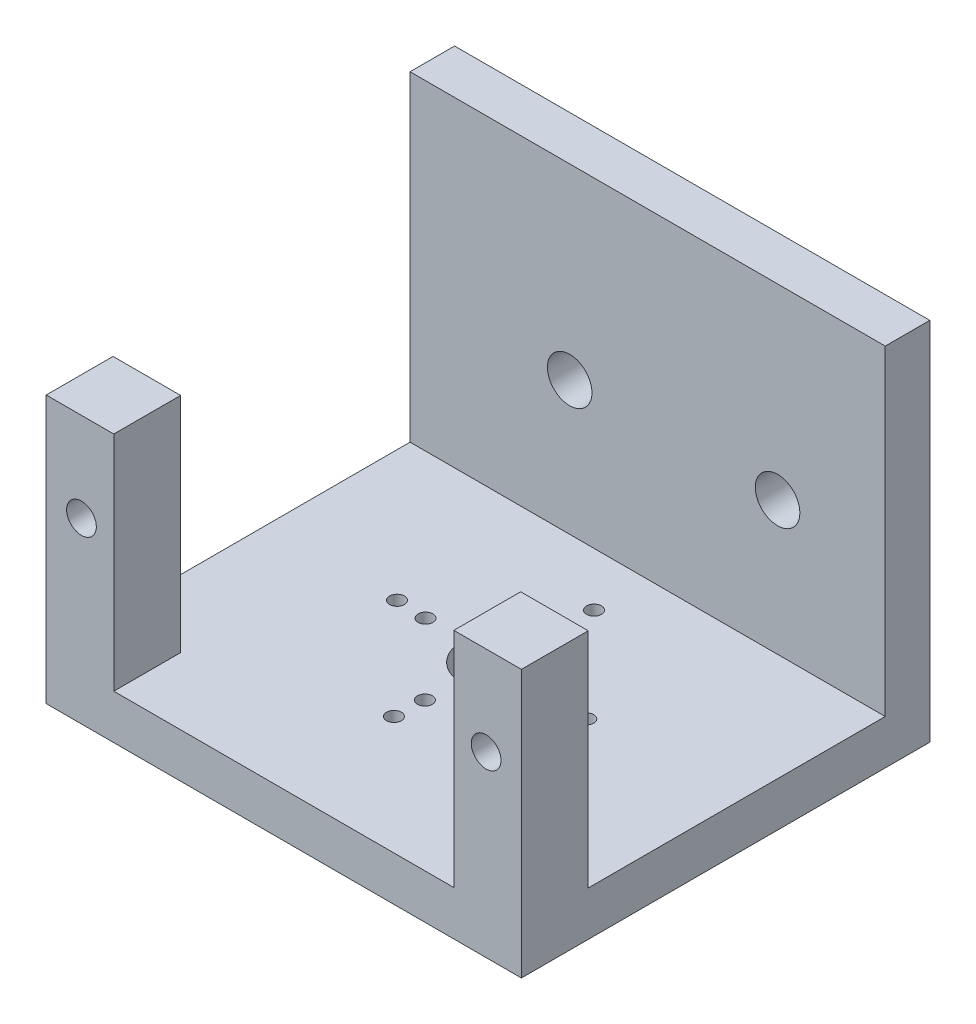
ISO-10303-21;
HEADER;
FILE_DESCRIPTION(('STEP AP214'),'2;1');
FILE_NAME('part.step','',(''),(''),'','','');
FILE_SCHEMA(('AUTOMOTIVE_DESIGN { 1 0 10303 214 1 1 1 1 }'));
ENDSEC;
DATA;
#1=APPLICATION_CONTEXT('core data for automotive mechanical design processes');
#2=APPLICATION_PROTOCOL_DEFINITION('international standard','automotive_design',2000,#1);
#3=PRODUCT_CONTEXT('',#1,'mechanical');
#4=PRODUCT('Part','Part','',(#3));
#5=PRODUCT_RELATED_PRODUCT_CATEGORY('part','',(#4));
#6=PRODUCT_DEFINITION_FORMATION('','',#4);
#7=PRODUCT_DEFINITION_CONTEXT('part definition',#1,'design');
#8=PRODUCT_DEFINITION('design','',#6,#7);
#9=PRODUCT_DEFINITION_SHAPE('','',#8);
#10=(LENGTH_UNIT() NAMED_UNIT(*) SI_UNIT(.MILLI.,.METRE.));
#11=(NAMED_UNIT(*) PLANE_ANGLE_UNIT() SI_UNIT($,.RADIAN.));
#12=(NAMED_UNIT(*) SI_UNIT($,.STERADIAN.) SOLID_ANGLE_UNIT());
#13=UNCERTAINTY_MEASURE_WITH_UNIT(LENGTH_MEASURE(1.E-05),#10,'distance_accuracy_value','');
#14=(GEOMETRIC_REPRESENTATION_CONTEXT(3) GLOBAL_UNCERTAINTY_ASSIGNED_CONTEXT((#13)) GLOBAL_UNIT_ASSIGNED_CONTEXT((#10,
#11,#12)) REPRESENTATION_CONTEXT('',''));
#15=CARTESIAN_POINT('',(0.,0.,0.));
#16=DIRECTION('',(0.,0.,1.));
#17=DIRECTION('',(1.,0.,0.));
#18=AXIS2_PLACEMENT_3D('',#15,#16,#17);
#19=CARTESIAN_POINT('',(0.,3.,0.));
#20=DIRECTION('',(0.,-1.,0.));
#21=DIRECTION('',(0.,0.,-1.));
#22=AXIS2_PLACEMENT_3D('',#19,#20,#21);
#23=PLANE('',#22);
#24=CARTESIAN_POINT('',(50.3881211809381,3.,-12.8250526524818));
#25=DIRECTION('',(0.,-1.,0.));
#26=DIRECTION('',(0.,0.,-1.));
#27=AXIS2_PLACEMENT_3D('',#24,#25,#26);
#28=CIRCLE('',#27,2.35);
#29=CARTESIAN_POINT('',(50.3881211809381,3.,-15.1750526524818));
#30=VERTEX_POINT('',#29);
#31=EDGE_CURVE('E159',#30,#30,#28,.T.);
#32=ORIENTED_EDGE('',*,*,#31,.T.);
#33=EDGE_LOOP('',(#32));
#34=FACE_BOUND('',#33,.T.);
#35=CARTESIAN_POINT('',(50.1172811230787,3.,-6.23061214072811));
#36=DIRECTION('',(0.,-1.,0.));
#37=DIRECTION('',(0.,0.,-1.));
#38=AXIS2_PLACEMENT_3D('',#35,#36,#37);
#39=CIRCLE('',#38,0.499999999999999);
#40=CARTESIAN_POINT('',(50.1172811230787,3.,-6.73061214072811));
#41=VERTEX_POINT('',#40);
#42=EDGE_CURVE('E216',#41,#41,#39,.T.);
#43=ORIENTED_EDGE('',*,*,#42,.T.);
#44=EDGE_LOOP('',(#43));
#45=FACE_BOUND('',#44,.T.);
#46=CARTESIAN_POINT('',(43.4439754905308,3.,-13.1102554406822));
#47=DIRECTION('',(0.,-1.,0.));
#48=DIRECTION('',(0.,0.,-1.));
#49=AXIS2_PLACEMENT_3D('',#46,#47,#48);
#50=CIRCLE('',#49,0.499999999999999);
#51=CARTESIAN_POINT('',(43.4439754905308,3.,-13.6102554406822));
#52=VERTEX_POINT('',#51);
#53=EDGE_CURVE('E213',#52,#52,#50,.T.);
#54=ORIENTED_EDGE('',*,*,#53,.T.);
#55=EDGE_LOOP('',(#54));
#56=FACE_BOUND('',#55,.T.);
#57=CARTESIAN_POINT('',(56.7327722793678,3.,-12.5644716877231));
#58=DIRECTION('',(0.,-1.,0.));
#59=DIRECTION('',(0.,0.,-1.));
#60=AXIS2_PLACEMENT_3D('',#57,#58,#59);
#61=CIRCLE('',#60,0.499999999999999);
#62=CARTESIAN_POINT('',(56.7327722793678,3.,-13.0644716877231));
#63=VERTEX_POINT('',#62);
#64=EDGE_CURVE('E210',#63,#63,#61,.T.);
#65=ORIENTED_EDGE('',*,*,#64,.T.);
#66=EDGE_LOOP('',(#65));
#67=FACE_BOUND('',#66,.T.);
#68=CARTESIAN_POINT('',(50.6487021456968,3.,-19.1697037509116));
#69=DIRECTION('',(0.,-1.,0.));
#70=DIRECTION('',(0.,0.,-1.));
#71=AXIS2_PLACEMENT_3D('',#68,#69,#70);
#72=CIRCLE('',#71,0.499999999999999);
#73=CARTESIAN_POINT('',(50.6487021456968,3.,-19.6697037509116));
#74=VERTEX_POINT('',#73);
#75=EDGE_CURVE('E207',#74,#74,#72,.T.);
#76=ORIENTED_EDGE('',*,*,#75,.T.);
#77=EDGE_LOOP('',(#76));
#78=FACE_BOUND('',#77,.T.);
#79=CARTESIAN_POINT('',(50.1993538678846,3.,-8.22892744732015));
#80=DIRECTION('',(0.,-1.,0.));
#81=DIRECTION('',(0.,0.,-1.));
#82=AXIS2_PLACEMENT_3D('',#79,#80,#81);
#83=CIRCLE('',#82,0.499999999999999);
#84=CARTESIAN_POINT('',(50.1993538678846,3.,-8.72892744732015));
#85=VERTEX_POINT('',#84);
#86=EDGE_CURVE('E204',#85,#85,#83,.T.);
#87=ORIENTED_EDGE('',*,*,#86,.T.);
#88=EDGE_LOOP('',(#87));
#89=FACE_BOUND('',#88,.T.);
#90=CARTESIAN_POINT('',(54.7344569727758,3.,-12.646544432529));
#91=DIRECTION('',(0.,-1.,0.));
#92=DIRECTION('',(0.,0.,-1.));
#93=AXIS2_PLACEMENT_3D('',#90,#91,#92);
#94=CIRCLE('',#93,0.499999999999999);
#95=CARTESIAN_POINT('',(54.7344569727758,3.,-13.146544432529));
#96=VERTEX_POINT('',#95);
#97=EDGE_CURVE('E201',#96,#96,#94,.T.);
#98=ORIENTED_EDGE('',*,*,#97,.T.);
#99=EDGE_LOOP('',(#98));
#100=FACE_BOUND('',#99,.T.);
#101=CARTESIAN_POINT('',(45.4422907971228,3.,-13.0281826958764));
#102=DIRECTION('',(0.,-1.,0.));
#103=DIRECTION('',(0.,0.,-1.));
#104=AXIS2_PLACEMENT_3D('',#101,#102,#103);
#105=CIRCLE('',#104,0.499999999999999);
#106=CARTESIAN_POINT('',(45.4422907971228,3.,-13.5281826958764));
#107=VERTEX_POINT('',#106);
#108=EDGE_CURVE('E198',#107,#107,#105,.T.);
#109=ORIENTED_EDGE('',*,*,#108,.T.);
#110=EDGE_LOOP('',(#109));
#111=FACE_BOUND('',#110,.T.);
#112=CARTESIAN_POINT('',(50.5666294008909,3.,-17.1713884443195));
#113=DIRECTION('',(0.,-1.,0.));
#114=DIRECTION('',(0.,0.,-1.));
#115=AXIS2_PLACEMENT_3D('',#112,#113,#114);
#116=CIRCLE('',#115,0.499999999999999);
#117=CARTESIAN_POINT('',(50.5666294008909,3.,-17.6713884443195));
#118=VERTEX_POINT('',#117);
#119=EDGE_CURVE('E175',#118,#118,#116,.T.);
#120=ORIENTED_EDGE('',*,*,#119,.T.);
#121=EDGE_LOOP('',(#120));
#122=FACE_BOUND('',#121,.T.);
#123=DIRECTION('',(0.,0.,-1.));
#124=VECTOR('',#123,1.);
#125=CARTESIAN_POINT('',(34.6589864705713,3.,0.));
#126=LINE('',#125,#124);
#127=CARTESIAN_POINT('',(34.6589864705713,3.,-2.76995645492283));
#128=VERTEX_POINT('',#127);
#129=CARTESIAN_POINT('',(34.6589864705713,3.,-22.7699564549228));
#130=VERTEX_POINT('',#129);
#131=EDGE_CURVE('E142',#128,#130,#126,.T.);
#132=ORIENTED_EDGE('',*,*,#131,.F.);
#133=DIRECTION('',(-1.,0.,0.));
#134=VECTOR('',#133,1.);
#135=CARTESIAN_POINT('',(39.2089864705713,3.,-2.76995645492283));
#136=LINE('',#135,#134);
#137=CARTESIAN_POINT('',(39.2089864705713,3.,-2.76995645492283));
#138=VERTEX_POINT('',#137);
#139=EDGE_CURVE('E239',#138,#128,#136,.T.);
#140=ORIENTED_EDGE('',*,*,#139,.F.);
#141=DIRECTION('',(0.,0.,1.));
#142=VECTOR('',#141,1.);
#143=CARTESIAN_POINT('',(39.2089864705713,3.,-18.4448567735852));
#144=LINE('',#143,#142);
#145=CARTESIAN_POINT('',(39.2089864705713,3.,1.73004354507717));
#146=VERTEX_POINT('',#145);
#147=EDGE_CURVE('E240',#138,#146,#144,.T.);
#148=ORIENTED_EDGE('',*,*,#147,.T.);
#149=DIRECTION('',(-1.,0.,0.));
#150=VECTOR('',#149,1.);
#151=CARTESIAN_POINT('',(66.6589864705713,3.,1.73004354507717));
#152=LINE('',#151,#150);
#153=CARTESIAN_POINT('',(62.1089864705713,3.,1.73004354507717));
#154=VERTEX_POINT('',#153);
#155=EDGE_CURVE('E276',#154,#146,#152,.T.);
#156=ORIENTED_EDGE('',*,*,#155,.F.);
#157=DIRECTION('',(0.,0.,1.));
#158=VECTOR('',#157,1.);
#159=CARTESIAN_POINT('',(62.1089864705713,3.,-18.4448567735852));
#160=LINE('',#159,#158);
#161=CARTESIAN_POINT('',(62.1089864705713,3.,-2.76995645492283));
#162=VERTEX_POINT('',#161);
#163=EDGE_CURVE('E262',#162,#154,#160,.T.);
#164=ORIENTED_EDGE('',*,*,#163,.F.);
#165=DIRECTION('',(-1.,0.,0.));
#166=VECTOR('',#165,1.);
#167=CARTESIAN_POINT('',(66.6589864705713,3.,-2.76995645492283));
#168=LINE('',#167,#166);
#169=CARTESIAN_POINT('',(66.6589864705713,3.,-2.76995645492283));
#170=VERTEX_POINT('',#169);
#171=EDGE_CURVE('E261',#170,#162,#168,.T.);
#172=ORIENTED_EDGE('',*,*,#171,.F.);
#173=DIRECTION('',(0.,0.,-1.));
#174=VECTOR('',#173,1.);
#175=CARTESIAN_POINT('',(66.6589864705713,3.,0.));
#176=LINE('',#175,#174);
#177=CARTESIAN_POINT('',(66.6589864705713,3.,-22.7699564549228));
#178=VERTEX_POINT('',#177);
#179=EDGE_CURVE('E11',#170,#178,#176,.T.);
#180=ORIENTED_EDGE('',*,*,#179,.T.);
#181=DIRECTION('',(-1.,0.,0.));
#182=VECTOR('',#181,1.);
#183=CARTESIAN_POINT('',(0.,3.,-22.7699564549228));
#184=LINE('',#183,#182);
#185=EDGE_CURVE('E149',#178,#130,#184,.T.);
#186=ORIENTED_EDGE('',*,*,#185,.T.);
#187=EDGE_LOOP('',(#132,#140,#148,#156,#164,#172,#180,#186));
#188=FACE_BOUND('',#187,.T.);
#189=ADVANCED_FACE('F33',(#34,#45,#56,#67,#78,#89,#100,#111,#122,#188),#23,.F.);
#190=CARTESIAN_POINT('',(0.,0.,0.));
#191=DIRECTION('',(0.,-1.,0.));
#192=DIRECTION('',(0.,0.,-1.));
#193=AXIS2_PLACEMENT_3D('',#190,#191,#192);
#194=PLANE('',#193);
#195=CARTESIAN_POINT('',(50.3881211809381,0.,-12.8250526524818));
#196=DIRECTION('',(0.,-1.,0.));
#197=DIRECTION('',(0.,0.,-1.));
#198=AXIS2_PLACEMENT_3D('',#195,#196,#197);
#199=CIRCLE('',#198,2.35);
#200=CARTESIAN_POINT('',(50.3881211809381,0.,-15.1750526524818));
#201=VERTEX_POINT('',#200);
#202=EDGE_CURVE('E154',#201,#201,#199,.T.);
#203=ORIENTED_EDGE('',*,*,#202,.F.);
#204=EDGE_LOOP('',(#203));
#205=FACE_BOUND('',#204,.T.);
#206=CARTESIAN_POINT('',(50.1172811230787,0.,-6.23061214072811));
#207=DIRECTION('',(0.,-1.,0.));
#208=DIRECTION('',(0.,0.,-1.));
#209=AXIS2_PLACEMENT_3D('',#206,#207,#208);
#210=CIRCLE('',#209,0.499999999999999);
#211=CARTESIAN_POINT('',(50.1172811230787,0.,-6.73061214072811));
#212=VERTEX_POINT('',#211);
#213=EDGE_CURVE('E172',#212,#212,#210,.T.);
#214=ORIENTED_EDGE('',*,*,#213,.F.);
#215=EDGE_LOOP('',(#214));
#216=FACE_BOUND('',#215,.T.);
#217=CARTESIAN_POINT('',(43.4439754905308,0.,-13.1102554406822));
#218=DIRECTION('',(0.,-1.,0.));
#219=DIRECTION('',(0.,0.,-1.));
#220=AXIS2_PLACEMENT_3D('',#217,#218,#219);
#221=CIRCLE('',#220,0.499999999999999);
#222=CARTESIAN_POINT('',(43.4439754905308,0.,-13.6102554406822));
#223=VERTEX_POINT('',#222);
#224=EDGE_CURVE('E171',#223,#223,#221,.T.);
#225=ORIENTED_EDGE('',*,*,#224,.F.);
#226=EDGE_LOOP('',(#225));
#227=FACE_BOUND('',#226,.T.);
#228=CARTESIAN_POINT('',(56.7327722793678,0.,-12.5644716877231));
#229=DIRECTION('',(0.,-1.,0.));
#230=DIRECTION('',(0.,0.,-1.));
#231=AXIS2_PLACEMENT_3D('',#228,#229,#230);
#232=CIRCLE('',#231,0.499999999999999);
#233=CARTESIAN_POINT('',(56.7327722793678,0.,-13.0644716877231));
#234=VERTEX_POINT('',#233);
#235=EDGE_CURVE('E181',#234,#234,#232,.T.);
#236=ORIENTED_EDGE('',*,*,#235,.F.);
#237=EDGE_LOOP('',(#236));
#238=FACE_BOUND('',#237,.T.);
#239=CARTESIAN_POINT('',(50.6487021456968,0.,-19.1697037509116));
#240=DIRECTION('',(0.,-1.,0.));
#241=DIRECTION('',(0.,0.,-1.));
#242=AXIS2_PLACEMENT_3D('',#239,#240,#241);
#243=CIRCLE('',#242,0.499999999999999);
#244=CARTESIAN_POINT('',(50.6487021456968,0.,-19.6697037509116));
#245=VERTEX_POINT('',#244);
#246=EDGE_CURVE('E177',#245,#245,#243,.T.);
#247=ORIENTED_EDGE('',*,*,#246,.F.);
#248=EDGE_LOOP('',(#247));
#249=FACE_BOUND('',#248,.T.);
#250=CARTESIAN_POINT('',(50.1993538678846,0.,-8.22892744732015));
#251=DIRECTION('',(0.,-1.,0.));
#252=DIRECTION('',(0.,0.,-1.));
#253=AXIS2_PLACEMENT_3D('',#250,#251,#252);
#254=CIRCLE('',#253,0.499999999999999);
#255=CARTESIAN_POINT('',(50.1993538678846,0.,-8.72892744732015));
#256=VERTEX_POINT('',#255);
#257=EDGE_CURVE('E176',#256,#256,#254,.T.);
#258=ORIENTED_EDGE('',*,*,#257,.F.);
#259=EDGE_LOOP('',(#258));
#260=FACE_BOUND('',#259,.T.);
#261=CARTESIAN_POINT('',(54.7344569727758,0.,-12.646544432529));
#262=DIRECTION('',(0.,-1.,0.));
#263=DIRECTION('',(0.,0.,-1.));
#264=AXIS2_PLACEMENT_3D('',#261,#262,#263);
#265=CIRCLE('',#264,0.499999999999999);
#266=CARTESIAN_POINT('',(54.7344569727758,0.,-13.146544432529));
#267=VERTEX_POINT('',#266);
#268=EDGE_CURVE('E189',#267,#267,#265,.T.);
#269=ORIENTED_EDGE('',*,*,#268,.F.);
#270=EDGE_LOOP('',(#269));
#271=FACE_BOUND('',#270,.T.);
#272=CARTESIAN_POINT('',(45.4422907971228,0.,-13.0281826958764));
#273=DIRECTION('',(0.,-1.,0.));
#274=DIRECTION('',(0.,0.,-1.));
#275=AXIS2_PLACEMENT_3D('',#272,#273,#274);
#276=CIRCLE('',#275,0.499999999999999);
#277=CARTESIAN_POINT('',(45.4422907971228,0.,-13.5281826958764));
#278=VERTEX_POINT('',#277);
#279=EDGE_CURVE('E186',#278,#278,#276,.T.);
#280=ORIENTED_EDGE('',*,*,#279,.F.);
#281=EDGE_LOOP('',(#280));
#282=FACE_BOUND('',#281,.T.);
#283=CARTESIAN_POINT('',(50.5666294008909,0.,-17.1713884443195));
#284=DIRECTION('',(0.,-1.,0.));
#285=DIRECTION('',(0.,0.,-1.));
#286=AXIS2_PLACEMENT_3D('',#283,#284,#285);
#287=CIRCLE('',#286,0.499999999999999);
#288=CARTESIAN_POINT('',(50.5666294008909,0.,-17.6713884443195));
#289=VERTEX_POINT('',#288);
#290=EDGE_CURVE('E180',#289,#289,#287,.T.);
#291=ORIENTED_EDGE('',*,*,#290,.F.);
#292=EDGE_LOOP('',(#291));
#293=FACE_BOUND('',#292,.T.);
#294=DIRECTION('',(1.,0.,0.));
#295=VECTOR('',#294,1.);
#296=CARTESIAN_POINT('',(66.6589864705713,0.,1.73004354507717));
#297=LINE('',#296,#295);
#298=CARTESIAN_POINT('',(34.6589864705713,0.,1.73004354507717));
#299=VERTEX_POINT('',#298);
#300=CARTESIAN_POINT('',(66.6589864705713,0.,1.73004354507717));
#301=VERTEX_POINT('',#300);
#302=EDGE_CURVE('E141',#299,#301,#297,.T.);
#303=ORIENTED_EDGE('',*,*,#302,.F.);
#304=DIRECTION('',(0.,0.,-1.));
#305=VECTOR('',#304,1.);
#306=CARTESIAN_POINT('',(34.6589864705713,0.,-25.7699564549228));
#307=LINE('',#306,#305);
#308=CARTESIAN_POINT('',(34.6589864705713,0.,-25.7699564549228));
#309=VERTEX_POINT('',#308);
#310=EDGE_CURVE('E128',#299,#309,#307,.T.);
#311=ORIENTED_EDGE('',*,*,#310,.T.);
#312=DIRECTION('',(-1.,0.,0.));
#313=VECTOR('',#312,1.);
#314=CARTESIAN_POINT('',(66.6589864705713,0.,-25.7699564549228));
#315=LINE('',#314,#313);
#316=CARTESIAN_POINT('',(66.6589864705713,0.,-25.7699564549228));
#317=VERTEX_POINT('',#316);
#318=EDGE_CURVE('E140',#317,#309,#315,.T.);
#319=ORIENTED_EDGE('',*,*,#318,.F.);
#320=DIRECTION('',(0.,0.,-1.));
#321=VECTOR('',#320,1.);
#322=CARTESIAN_POINT('',(66.6589864705713,0.,0.));
#323=LINE('',#322,#321);
#324=EDGE_CURVE('E146',#301,#317,#323,.T.);
#325=ORIENTED_EDGE('',*,*,#324,.F.);
#326=EDGE_LOOP('',(#303,#311,#319,#325));
#327=FACE_BOUND('',#326,.T.);
#328=ADVANCED_FACE('F35',(#205,#216,#227,#238,#249,#260,#271,#282,#293,#327),#194,.T.);
#329=CARTESIAN_POINT('',(66.6589864705713,10.,-25.7699564549228));
#330=DIRECTION('',(0.,0.,1.));
#331=DIRECTION('',(1.,0.,0.));
#332=AXIS2_PLACEMENT_3D('',#329,#330,#331);
#333=PLANE('',#332);
#334=CARTESIAN_POINT('',(59.4089864705713,12.,-25.7699564549228));
#335=DIRECTION('',(0.,0.,-1.));
#336=DIRECTION('',(-1.,0.,0.));
#337=AXIS2_PLACEMENT_3D('',#334,#335,#336);
#338=CIRCLE('',#337,1.5);
#339=CARTESIAN_POINT('',(57.9089864705713,12.,-25.7699564549228));
#340=VERTEX_POINT('',#339);
#341=EDGE_CURVE('E166',#340,#340,#338,.T.);
#342=ORIENTED_EDGE('',*,*,#341,.F.);
#343=EDGE_LOOP('',(#342));
#344=FACE_BOUND('',#343,.T.);
#345=CARTESIAN_POINT('',(45.4089864705713,12.,-25.7699564549228));
#346=DIRECTION('',(0.,0.,-1.));
#347=DIRECTION('',(-1.,0.,0.));
#348=AXIS2_PLACEMENT_3D('',#345,#346,#347);
#349=CIRCLE('',#348,1.5);
#350=CARTESIAN_POINT('',(43.9089864705713,12.,-25.7699564549228));
#351=VERTEX_POINT('',#350);
#352=EDGE_CURVE('E155',#351,#351,#349,.T.);
#353=ORIENTED_EDGE('',*,*,#352,.F.);
#354=EDGE_LOOP('',(#353));
#355=FACE_BOUND('',#354,.T.);
#356=DIRECTION('',(0.,1.,0.));
#357=VECTOR('',#356,1.);
#358=CARTESIAN_POINT('',(34.6589864705713,24.603040440013,-25.7699564549228));
#359=LINE('',#358,#357);
#360=CARTESIAN_POINT('',(34.6589864705713,24.603040440013,-25.7699564549228));
#361=VERTEX_POINT('',#360);
#362=EDGE_CURVE('E124',#309,#361,#359,.T.);
#363=ORIENTED_EDGE('',*,*,#362,.T.);
#364=DIRECTION('',(-1.,0.,0.));
#365=VECTOR('',#364,1.);
#366=CARTESIAN_POINT('',(66.6589864705713,24.603040440013,-25.7699564549228));
#367=LINE('',#366,#365);
#368=CARTESIAN_POINT('',(66.6589864705713,24.603040440013,-25.7699564549228));
#369=VERTEX_POINT('',#368);
#370=EDGE_CURVE('E278',#369,#361,#367,.T.);
#371=ORIENTED_EDGE('',*,*,#370,.F.);
#372=DIRECTION('',(0.,-1.,0.));
#373=VECTOR('',#372,1.);
#374=CARTESIAN_POINT('',(66.6589864705713,10.,-25.7699564549228));
#375=LINE('',#374,#373);
#376=EDGE_CURVE('E42',#369,#317,#375,.T.);
#377=ORIENTED_EDGE('',*,*,#376,.T.);
#378=ORIENTED_EDGE('',*,*,#318,.T.);
#379=EDGE_LOOP('',(#363,#371,#377,#378));
#380=FACE_BOUND('',#379,.T.);
#381=ADVANCED_FACE('F145',(#344,#355,#380),#333,.F.);
#382=CARTESIAN_POINT('',(0.,0.,-22.7699564549228));
#383=DIRECTION('',(0.,0.,1.));
#384=DIRECTION('',(1.,0.,0.));
#385=AXIS2_PLACEMENT_3D('',#382,#383,#384);
#386=PLANE('',#385);
#387=CARTESIAN_POINT('',(59.4089864705713,12.,-22.7699564549228));
#388=DIRECTION('',(0.,0.,1.));
#389=DIRECTION('',(1.,0.,0.));
#390=AXIS2_PLACEMENT_3D('',#387,#388,#389);
#391=CIRCLE('',#390,1.5);
#392=CARTESIAN_POINT('',(60.9089864705713,12.,-22.7699564549228));
#393=VERTEX_POINT('',#392);
#394=EDGE_CURVE('E37',#393,#393,#391,.T.);
#395=ORIENTED_EDGE('',*,*,#394,.F.);
#396=EDGE_LOOP('',(#395));
#397=FACE_BOUND('',#396,.T.);
#398=CARTESIAN_POINT('',(45.4089864705713,12.,-22.7699564549228));
#399=DIRECTION('',(0.,0.,1.));
#400=DIRECTION('',(1.,0.,0.));
#401=AXIS2_PLACEMENT_3D('',#398,#399,#400);
#402=CIRCLE('',#401,1.5);
#403=CARTESIAN_POINT('',(46.9089864705713,12.,-22.7699564549228));
#404=VERTEX_POINT('',#403);
#405=EDGE_CURVE('E152',#404,#404,#402,.T.);
#406=ORIENTED_EDGE('',*,*,#405,.F.);
#407=EDGE_LOOP('',(#406));
#408=FACE_BOUND('',#407,.T.);
#409=DIRECTION('',(-1.,0.,0.));
#410=VECTOR('',#409,1.);
#411=CARTESIAN_POINT('',(66.6589864705713,24.603040440013,-22.7699564549228));
#412=LINE('',#411,#410);
#413=CARTESIAN_POINT('',(66.6589864705713,24.603040440013,-22.7699564549228));
#414=VERTEX_POINT('',#413);
#415=CARTESIAN_POINT('',(34.6589864705713,24.603040440013,-22.7699564549228));
#416=VERTEX_POINT('',#415);
#417=EDGE_CURVE('E284',#414,#416,#412,.T.);
#418=ORIENTED_EDGE('',*,*,#417,.T.);
#419=DIRECTION('',(0.,-1.,0.));
#420=VECTOR('',#419,1.);
#421=CARTESIAN_POINT('',(34.6589864705713,0.,-22.7699564549228));
#422=LINE('',#421,#420);
#423=EDGE_CURVE('E233',#416,#130,#422,.T.);
#424=ORIENTED_EDGE('',*,*,#423,.T.);
#425=ORIENTED_EDGE('',*,*,#185,.F.);
#426=DIRECTION('',(0.,1.,0.));
#427=VECTOR('',#426,1.);
#428=CARTESIAN_POINT('',(66.6589864705713,0.,-22.7699564549228));
#429=LINE('',#428,#427);
#430=EDGE_CURVE('E282',#178,#414,#429,.T.);
#431=ORIENTED_EDGE('',*,*,#430,.T.);
#432=EDGE_LOOP('',(#418,#424,#425,#431));
#433=FACE_BOUND('',#432,.T.);
#434=ADVANCED_FACE('F298',(#397,#408,#433),#386,.T.);
#435=CARTESIAN_POINT('',(66.6589864705713,24.603040440013,-22.7699564549228));
#436=DIRECTION('',(0.,-1.,0.));
#437=DIRECTION('',(0.,0.,-1.));
#438=AXIS2_PLACEMENT_3D('',#435,#436,#437);
#439=PLANE('',#438);
#440=DIRECTION('',(0.,0.,1.));
#441=VECTOR('',#440,1.);
#442=CARTESIAN_POINT('',(34.6589864705713,24.603040440013,-25.7699564549228));
#443=LINE('',#442,#441);
#444=EDGE_CURVE('E131',#361,#416,#443,.T.);
#445=ORIENTED_EDGE('',*,*,#444,.T.);
#446=ORIENTED_EDGE('',*,*,#417,.F.);
#447=DIRECTION('',(0.,0.,-1.));
#448=VECTOR('',#447,1.);
#449=CARTESIAN_POINT('',(66.6589864705713,24.603040440013,-22.7699564549228));
#450=LINE('',#449,#448);
#451=EDGE_CURVE('E287',#414,#369,#450,.T.);
#452=ORIENTED_EDGE('',*,*,#451,.T.);
#453=ORIENTED_EDGE('',*,*,#370,.T.);
#454=EDGE_LOOP('',(#445,#446,#452,#453));
#455=FACE_BOUND('',#454,.T.);
#456=ADVANCED_FACE('F305',(#455),#439,.F.);
#457=CARTESIAN_POINT('',(50.6589864705715,12.,1.73004354507717));
#458=DIRECTION('',(0.,0.,1.));
#459=DIRECTION('',(0.,-1.,0.));
#460=AXIS2_PLACEMENT_3D('',#457,#458,#459);
#461=PLANE('',#460);
#462=CARTESIAN_POINT('',(37.0339864705713,12.,1.73004354507717));
#463=DIRECTION('',(0.,0.,1.));
#464=DIRECTION('',(0.,-1.,0.));
#465=AXIS2_PLACEMENT_3D('',#462,#463,#464);
#466=CIRCLE('',#465,0.999999999999998);
#467=CARTESIAN_POINT('',(37.0339864705713,11.,1.73004354507717));
#468=VERTEX_POINT('',#467);
#469=EDGE_CURVE('E223',#468,#468,#466,.T.);
#470=ORIENTED_EDGE('',*,*,#469,.F.);
#471=EDGE_LOOP('',(#470));
#472=FACE_BOUND('',#471,.T.);
#473=CARTESIAN_POINT('',(64.2839864705713,12.,1.73004354507717));
#474=DIRECTION('',(0.,0.,1.));
#475=DIRECTION('',(0.,-1.,0.));
#476=AXIS2_PLACEMENT_3D('',#473,#474,#475);
#477=CIRCLE('',#476,0.999999999999998);
#478=CARTESIAN_POINT('',(64.2839864705713,11.,1.73004354507717));
#479=VERTEX_POINT('',#478);
#480=EDGE_CURVE('E228',#479,#479,#477,.T.);
#481=ORIENTED_EDGE('',*,*,#480,.F.);
#482=EDGE_LOOP('',(#481));
#483=FACE_BOUND('',#482,.T.);
#484=DIRECTION('',(0.,-1.,0.));
#485=VECTOR('',#484,1.);
#486=CARTESIAN_POINT('',(34.6589864705713,18.,1.73004354507717));
#487=LINE('',#486,#485);
#488=CARTESIAN_POINT('',(34.6589864705713,18.,1.73004354507717));
#489=VERTEX_POINT('',#488);
#490=EDGE_CURVE('E50',#489,#299,#487,.T.);
#491=ORIENTED_EDGE('',*,*,#490,.T.);
#492=ORIENTED_EDGE('',*,*,#302,.T.);
#493=DIRECTION('',(0.,1.,0.));
#494=VECTOR('',#493,1.);
#495=CARTESIAN_POINT('',(66.6589864705713,0.,1.73004354507717));
#496=LINE('',#495,#494);
#497=CARTESIAN_POINT('',(66.6589864705713,18.,1.73004354507717));
#498=VERTEX_POINT('',#497);
#499=EDGE_CURVE('E279',#301,#498,#496,.T.);
#500=ORIENTED_EDGE('',*,*,#499,.T.);
#501=DIRECTION('',(-1.,0.,0.));
#502=VECTOR('',#501,1.);
#503=CARTESIAN_POINT('',(66.6589864705713,18.,1.73004354507717));
#504=LINE('',#503,#502);
#505=CARTESIAN_POINT('',(62.1089864705713,18.,1.73004354507717));
#506=VERTEX_POINT('',#505);
#507=EDGE_CURVE('E258',#498,#506,#504,.T.);
#508=ORIENTED_EDGE('',*,*,#507,.T.);
#509=DIRECTION('',(0.,-1.,0.));
#510=VECTOR('',#509,1.);
#511=CARTESIAN_POINT('',(62.1089864705713,3.,1.73004354507717));
#512=LINE('',#511,#510);
#513=EDGE_CURVE('E57',#506,#154,#512,.T.);
#514=ORIENTED_EDGE('',*,*,#513,.T.);
#515=ORIENTED_EDGE('',*,*,#155,.T.);
#516=DIRECTION('',(0.,1.,0.));
#517=VECTOR('',#516,1.);
#518=CARTESIAN_POINT('',(39.2089864705713,18.,1.73004354507717));
#519=LINE('',#518,#517);
#520=CARTESIAN_POINT('',(39.2089864705713,18.,1.73004354507717));
#521=VERTEX_POINT('',#520);
#522=EDGE_CURVE('E236',#146,#521,#519,.T.);
#523=ORIENTED_EDGE('',*,*,#522,.T.);
#524=DIRECTION('',(-1.,0.,0.));
#525=VECTOR('',#524,1.);
#526=CARTESIAN_POINT('',(39.2089864705713,18.,1.73004354507717));
#527=LINE('',#526,#525);
#528=EDGE_CURVE('E248',#521,#489,#527,.T.);
#529=ORIENTED_EDGE('',*,*,#528,.T.);
#530=EDGE_LOOP('',(#491,#492,#500,#508,#514,#515,#523,#529));
#531=FACE_BOUND('',#530,.T.);
#532=ADVANCED_FACE('F307',(#472,#483,#531),#461,.T.);
#533=CARTESIAN_POINT('',(66.6589864705713,10.,0.));
#534=DIRECTION('',(-1.,0.,0.));
#535=DIRECTION('',(0.,0.,1.));
#536=AXIS2_PLACEMENT_3D('',#533,#534,#535);
#537=PLANE('',#536);
#538=ORIENTED_EDGE('',*,*,#324,.T.);
#539=ORIENTED_EDGE('',*,*,#376,.F.);
#540=ORIENTED_EDGE('',*,*,#451,.F.);
#541=ORIENTED_EDGE('',*,*,#430,.F.);
#542=ORIENTED_EDGE('',*,*,#179,.F.);
#543=DIRECTION('',(0.,-1.,0.));
#544=VECTOR('',#543,1.);
#545=CARTESIAN_POINT('',(66.6589864705713,3.,-2.76995645492283));
#546=LINE('',#545,#544);
#547=CARTESIAN_POINT('',(66.6589864705713,18.,-2.76995645492283));
#548=VERTEX_POINT('',#547);
#549=EDGE_CURVE('E264',#548,#170,#546,.T.);
#550=ORIENTED_EDGE('',*,*,#549,.F.);
#551=DIRECTION('',(0.,0.,1.));
#552=VECTOR('',#551,1.);
#553=CARTESIAN_POINT('',(66.6589864705713,18.,-18.4448567735852));
#554=LINE('',#553,#552);
#555=EDGE_CURVE('E269',#548,#498,#554,.T.);
#556=ORIENTED_EDGE('',*,*,#555,.T.);
#557=ORIENTED_EDGE('',*,*,#499,.F.);
#558=EDGE_LOOP('',(#538,#539,#540,#541,#542,#550,#556,#557));
#559=FACE_BOUND('',#558,.T.);
#560=ADVANCED_FACE('F302',(#559),#537,.F.);
#561=CARTESIAN_POINT('',(62.1089864705713,3.,-18.4448567735852));
#562=DIRECTION('',(-1.,0.,0.));
#563=DIRECTION('',(0.,0.,1.));
#564=AXIS2_PLACEMENT_3D('',#561,#562,#563);
#565=PLANE('',#564);
#566=DIRECTION('',(0.,1.,0.));
#567=VECTOR('',#566,1.);
#568=CARTESIAN_POINT('',(62.1089864705713,3.,-2.76995645492283));
#569=LINE('',#568,#567);
#570=CARTESIAN_POINT('',(62.1089864705713,18.,-2.76995645492283));
#571=VERTEX_POINT('',#570);
#572=EDGE_CURVE('E259',#162,#571,#569,.T.);
#573=ORIENTED_EDGE('',*,*,#572,.F.);
#574=ORIENTED_EDGE('',*,*,#163,.T.);
#575=ORIENTED_EDGE('',*,*,#513,.F.);
#576=DIRECTION('',(0.,0.,1.));
#577=VECTOR('',#576,1.);
#578=CARTESIAN_POINT('',(62.1089864705713,18.,-18.4448567735852));
#579=LINE('',#578,#577);
#580=EDGE_CURVE('E271',#571,#506,#579,.T.);
#581=ORIENTED_EDGE('',*,*,#580,.F.);
#582=EDGE_LOOP('',(#573,#574,#575,#581));
#583=FACE_BOUND('',#582,.T.);
#584=ADVANCED_FACE('F327',(#583),#565,.T.);
#585=CARTESIAN_POINT('',(66.6589864705713,18.,-18.4448567735852));
#586=DIRECTION('',(0.,1.,0.));
#587=DIRECTION('',(0.,0.,1.));
#588=AXIS2_PLACEMENT_3D('',#585,#586,#587);
#589=PLANE('',#588);
#590=DIRECTION('',(1.,0.,0.));
#591=VECTOR('',#590,1.);
#592=CARTESIAN_POINT('',(66.6589864705713,18.,-2.76995645492283));
#593=LINE('',#592,#591);
#594=EDGE_CURVE('E266',#571,#548,#593,.T.);
#595=ORIENTED_EDGE('',*,*,#594,.F.);
#596=ORIENTED_EDGE('',*,*,#580,.T.);
#597=ORIENTED_EDGE('',*,*,#507,.F.);
#598=ORIENTED_EDGE('',*,*,#555,.F.);
#599=EDGE_LOOP('',(#595,#596,#597,#598));
#600=FACE_BOUND('',#599,.T.);
#601=ADVANCED_FACE('F407',(#600),#589,.T.);
#602=CARTESIAN_POINT('',(37.0339864705715,12.,-2.76995645492283));
#603=DIRECTION('',(0.,0.,1.));
#604=DIRECTION('',(0.,-1.,0.));
#605=AXIS2_PLACEMENT_3D('',#602,#603,#604);
#606=PLANE('',#605);
#607=CARTESIAN_POINT('',(64.2839864705713,12.,-2.76995645492283));
#608=DIRECTION('',(0.,0.,-1.));
#609=DIRECTION('',(-1.,0.,0.));
#610=AXIS2_PLACEMENT_3D('',#607,#608,#609);
#611=CIRCLE('',#610,0.999999999999998);
#612=CARTESIAN_POINT('',(63.2839864705713,12.,-2.76995645492283));
#613=VERTEX_POINT('',#612);
#614=EDGE_CURVE('E219',#613,#613,#611,.T.);
#615=ORIENTED_EDGE('',*,*,#614,.F.);
#616=EDGE_LOOP('',(#615));
#617=FACE_BOUND('',#616,.T.);
#618=ORIENTED_EDGE('',*,*,#549,.T.);
#619=ORIENTED_EDGE('',*,*,#171,.T.);
#620=ORIENTED_EDGE('',*,*,#572,.T.);
#621=ORIENTED_EDGE('',*,*,#594,.T.);
#622=EDGE_LOOP('',(#618,#619,#620,#621));
#623=FACE_BOUND('',#622,.T.);
#624=ADVANCED_FACE('F403',(#617,#623),#606,.F.);
#625=CARTESIAN_POINT('',(39.2089864705713,18.,-18.4448567735852));
#626=DIRECTION('',(1.,0.,0.));
#627=DIRECTION('',(0.,0.,-1.));
#628=AXIS2_PLACEMENT_3D('',#625,#626,#627);
#629=PLANE('',#628);
#630=DIRECTION('',(0.,-1.,0.));
#631=VECTOR('',#630,1.);
#632=CARTESIAN_POINT('',(39.2089864705713,18.,-2.76995645492283));
#633=LINE('',#632,#631);
#634=CARTESIAN_POINT('',(39.2089864705713,18.,-2.76995645492283));
#635=VERTEX_POINT('',#634);
#636=EDGE_CURVE('E243',#635,#138,#633,.T.);
#637=ORIENTED_EDGE('',*,*,#636,.F.);
#638=DIRECTION('',(0.,0.,1.));
#639=VECTOR('',#638,1.);
#640=CARTESIAN_POINT('',(39.2089864705713,18.,-18.4448567735852));
#641=LINE('',#640,#639);
#642=EDGE_CURVE('E251',#635,#521,#641,.T.);
#643=ORIENTED_EDGE('',*,*,#642,.T.);
#644=ORIENTED_EDGE('',*,*,#522,.F.);
#645=ORIENTED_EDGE('',*,*,#147,.F.);
#646=EDGE_LOOP('',(#637,#643,#644,#645));
#647=FACE_BOUND('',#646,.T.);
#648=ADVANCED_FACE('F397',(#647),#629,.T.);
#649=CARTESIAN_POINT('',(34.6589864705713,18.,-18.4448567735852));
#650=DIRECTION('',(-1.,0.,0.));
#651=DIRECTION('',(0.,0.,1.));
#652=AXIS2_PLACEMENT_3D('',#649,#650,#651);
#653=PLANE('',#652);
#654=DIRECTION('',(0.,1.,0.));
#655=VECTOR('',#654,1.);
#656=CARTESIAN_POINT('',(34.6589864705713,18.,-2.76995645492283));
#657=LINE('',#656,#655);
#658=CARTESIAN_POINT('',(34.6589864705713,18.,-2.76995645492283));
#659=VERTEX_POINT('',#658);
#660=EDGE_CURVE('E237',#128,#659,#657,.T.);
#661=ORIENTED_EDGE('',*,*,#660,.F.);
#662=ORIENTED_EDGE('',*,*,#131,.T.);
#663=ORIENTED_EDGE('',*,*,#423,.F.);
#664=ORIENTED_EDGE('',*,*,#444,.F.);
#665=ORIENTED_EDGE('',*,*,#362,.F.);
#666=ORIENTED_EDGE('',*,*,#310,.F.);
#667=ORIENTED_EDGE('',*,*,#490,.F.);
#668=DIRECTION('',(0.,0.,1.));
#669=VECTOR('',#668,1.);
#670=CARTESIAN_POINT('',(34.6589864705713,18.,-18.4448567735852));
#671=LINE('',#670,#669);
#672=EDGE_CURVE('E254',#659,#489,#671,.T.);
#673=ORIENTED_EDGE('',*,*,#672,.F.);
#674=EDGE_LOOP('',(#661,#662,#663,#664,#665,#666,#667,#673));
#675=FACE_BOUND('',#674,.T.);
#676=ADVANCED_FACE('F127',(#675),#653,.T.);
#677=CARTESIAN_POINT('',(39.2089864705713,18.,-18.4448567735852));
#678=DIRECTION('',(0.,1.,0.));
#679=DIRECTION('',(0.,0.,1.));
#680=AXIS2_PLACEMENT_3D('',#677,#678,#679);
#681=PLANE('',#680);
#682=DIRECTION('',(1.,0.,0.));
#683=VECTOR('',#682,1.);
#684=CARTESIAN_POINT('',(39.2089864705713,18.,-2.76995645492283));
#685=LINE('',#684,#683);
#686=EDGE_CURVE('E245',#659,#635,#685,.T.);
#687=ORIENTED_EDGE('',*,*,#686,.F.);
#688=ORIENTED_EDGE('',*,*,#672,.T.);
#689=ORIENTED_EDGE('',*,*,#528,.F.);
#690=ORIENTED_EDGE('',*,*,#642,.F.);
#691=EDGE_LOOP('',(#687,#688,#689,#690));
#692=FACE_BOUND('',#691,.T.);
#693=ADVANCED_FACE('F393',(#692),#681,.T.);
#694=CARTESIAN_POINT('',(37.0339864705715,12.,-2.76995645492283));
#695=DIRECTION('',(0.,0.,1.));
#696=DIRECTION('',(0.,-1.,0.));
#697=AXIS2_PLACEMENT_3D('',#694,#695,#696);
#698=PLANE('',#697);
#699=CARTESIAN_POINT('',(37.0339864705713,12.,-2.76995645492283));
#700=DIRECTION('',(0.,0.,-1.));
#701=DIRECTION('',(-1.,0.,0.));
#702=AXIS2_PLACEMENT_3D('',#699,#700,#701);
#703=CIRCLE('',#702,0.999999999999998);
#704=CARTESIAN_POINT('',(36.0339864705713,12.,-2.76995645492283));
#705=VERTEX_POINT('',#704);
#706=EDGE_CURVE('E220',#705,#705,#703,.T.);
#707=ORIENTED_EDGE('',*,*,#706,.F.);
#708=EDGE_LOOP('',(#707));
#709=FACE_BOUND('',#708,.T.);
#710=ORIENTED_EDGE('',*,*,#636,.T.);
#711=ORIENTED_EDGE('',*,*,#139,.T.);
#712=ORIENTED_EDGE('',*,*,#660,.T.);
#713=ORIENTED_EDGE('',*,*,#686,.T.);
#714=EDGE_LOOP('',(#710,#711,#712,#713));
#715=FACE_BOUND('',#714,.T.);
#716=ADVANCED_FACE('F386',(#709,#715),#698,.F.);
#717=CARTESIAN_POINT('',(37.0339864705713,12.,7.23004354507717));
#718=DIRECTION('',(0.,0.,-1.));
#719=DIRECTION('',(-1.,0.,0.));
#720=AXIS2_PLACEMENT_3D('',#717,#718,#719);
#721=CYLINDRICAL_SURFACE('',#720,0.999999999999998);
#722=ORIENTED_EDGE('',*,*,#469,.T.);
#723=EDGE_LOOP('',(#722));
#724=FACE_BOUND('',#723,.T.);
#725=ORIENTED_EDGE('',*,*,#706,.T.);
#726=EDGE_LOOP('',(#725));
#727=FACE_BOUND('',#726,.T.);
#728=ADVANCED_FACE('F383',(#724,#727),#721,.F.);
#729=CARTESIAN_POINT('',(64.2839864705713,12.,7.23004354507717));
#730=DIRECTION('',(0.,0.,-1.));
#731=DIRECTION('',(-1.,0.,0.));
#732=AXIS2_PLACEMENT_3D('',#729,#730,#731);
#733=CYLINDRICAL_SURFACE('',#732,0.999999999999998);
#734=ORIENTED_EDGE('',*,*,#480,.T.);
#735=EDGE_LOOP('',(#734));
#736=FACE_BOUND('',#735,.T.);
#737=ORIENTED_EDGE('',*,*,#614,.T.);
#738=EDGE_LOOP('',(#737));
#739=FACE_BOUND('',#738,.T.);
#740=ADVANCED_FACE('F375',(#736,#739),#733,.F.);
#741=CARTESIAN_POINT('',(50.5666294008909,10.,-17.1713884443195));
#742=DIRECTION('',(0.,-1.,0.));
#743=DIRECTION('',(0.,0.,-1.));
#744=AXIS2_PLACEMENT_3D('',#741,#742,#743);
#745=CYLINDRICAL_SURFACE('',#744,0.499999999999999);
#746=ORIENTED_EDGE('',*,*,#290,.T.);
#747=EDGE_LOOP('',(#746));
#748=FACE_BOUND('',#747,.T.);
#749=ORIENTED_EDGE('',*,*,#119,.F.);
#750=EDGE_LOOP('',(#749));
#751=FACE_BOUND('',#750,.T.);
#752=ADVANCED_FACE('F371',(#748,#751),#745,.F.);
#753=CARTESIAN_POINT('',(45.4422907971228,10.,-13.0281826958764));
#754=DIRECTION('',(0.,-1.,0.));
#755=DIRECTION('',(0.,0.,-1.));
#756=AXIS2_PLACEMENT_3D('',#753,#754,#755);
#757=CYLINDRICAL_SURFACE('',#756,0.499999999999999);
#758=ORIENTED_EDGE('',*,*,#279,.T.);
#759=EDGE_LOOP('',(#758));
#760=FACE_BOUND('',#759,.T.);
#761=ORIENTED_EDGE('',*,*,#108,.F.);
#762=EDGE_LOOP('',(#761));
#763=FACE_BOUND('',#762,.T.);
#764=ADVANCED_FACE('F367',(#760,#763),#757,.F.);
#765=CARTESIAN_POINT('',(54.7344569727758,10.,-12.646544432529));
#766=DIRECTION('',(0.,-1.,0.));
#767=DIRECTION('',(0.,0.,-1.));
#768=AXIS2_PLACEMENT_3D('',#765,#766,#767);
#769=CYLINDRICAL_SURFACE('',#768,0.499999999999999);
#770=ORIENTED_EDGE('',*,*,#268,.T.);
#771=EDGE_LOOP('',(#770));
#772=FACE_BOUND('',#771,.T.);
#773=ORIENTED_EDGE('',*,*,#97,.F.);
#774=EDGE_LOOP('',(#773));
#775=FACE_BOUND('',#774,.T.);
#776=ADVANCED_FACE('F370',(#772,#775),#769,.F.);
#777=CARTESIAN_POINT('',(50.1993538678846,10.,-8.22892744732015));
#778=DIRECTION('',(0.,-1.,0.));
#779=DIRECTION('',(0.,0.,-1.));
#780=AXIS2_PLACEMENT_3D('',#777,#778,#779);
#781=CYLINDRICAL_SURFACE('',#780,0.499999999999999);
#782=ORIENTED_EDGE('',*,*,#257,.T.);
#783=EDGE_LOOP('',(#782));
#784=FACE_BOUND('',#783,.T.);
#785=ORIENTED_EDGE('',*,*,#86,.F.);
#786=EDGE_LOOP('',(#785));
#787=FACE_BOUND('',#786,.T.);
#788=ADVANCED_FACE('F359',(#784,#787),#781,.F.);
#789=CARTESIAN_POINT('',(50.6487021456968,10.,-19.1697037509116));
#790=DIRECTION('',(0.,-1.,0.));
#791=DIRECTION('',(0.,0.,-1.));
#792=AXIS2_PLACEMENT_3D('',#789,#790,#791);
#793=CYLINDRICAL_SURFACE('',#792,0.499999999999999);
#794=ORIENTED_EDGE('',*,*,#246,.T.);
#795=EDGE_LOOP('',(#794));
#796=FACE_BOUND('',#795,.T.);
#797=ORIENTED_EDGE('',*,*,#75,.F.);
#798=EDGE_LOOP('',(#797));
#799=FACE_BOUND('',#798,.T.);
#800=ADVANCED_FACE('F355',(#796,#799),#793,.F.);
#801=CARTESIAN_POINT('',(56.7327722793678,10.,-12.5644716877231));
#802=DIRECTION('',(0.,-1.,0.));
#803=DIRECTION('',(0.,0.,-1.));
#804=AXIS2_PLACEMENT_3D('',#801,#802,#803);
#805=CYLINDRICAL_SURFACE('',#804,0.499999999999999);
#806=ORIENTED_EDGE('',*,*,#235,.T.);
#807=EDGE_LOOP('',(#806));
#808=FACE_BOUND('',#807,.T.);
#809=ORIENTED_EDGE('',*,*,#64,.F.);
#810=EDGE_LOOP('',(#809));
#811=FACE_BOUND('',#810,.T.);
#812=ADVANCED_FACE('F358',(#808,#811),#805,.F.);
#813=CARTESIAN_POINT('',(43.4439754905308,10.,-13.1102554406822));
#814=DIRECTION('',(0.,-1.,0.));
#815=DIRECTION('',(0.,0.,-1.));
#816=AXIS2_PLACEMENT_3D('',#813,#814,#815);
#817=CYLINDRICAL_SURFACE('',#816,0.499999999999999);
#818=ORIENTED_EDGE('',*,*,#224,.T.);
#819=EDGE_LOOP('',(#818));
#820=FACE_BOUND('',#819,.T.);
#821=ORIENTED_EDGE('',*,*,#53,.F.);
#822=EDGE_LOOP('',(#821));
#823=FACE_BOUND('',#822,.T.);
#824=ADVANCED_FACE('F353',(#820,#823),#817,.F.);
#825=CARTESIAN_POINT('',(50.1172811230787,10.,-6.23061214072811));
#826=DIRECTION('',(0.,-1.,0.));
#827=DIRECTION('',(0.,0.,-1.));
#828=AXIS2_PLACEMENT_3D('',#825,#826,#827);
#829=CYLINDRICAL_SURFACE('',#828,0.499999999999999);
#830=ORIENTED_EDGE('',*,*,#213,.T.);
#831=EDGE_LOOP('',(#830));
#832=FACE_BOUND('',#831,.T.);
#833=ORIENTED_EDGE('',*,*,#42,.F.);
#834=EDGE_LOOP('',(#833));
#835=FACE_BOUND('',#834,.T.);
#836=ADVANCED_FACE('F349',(#832,#835),#829,.F.);
#837=CARTESIAN_POINT('',(50.3881211809381,10.,-12.8250526524818));
#838=DIRECTION('',(0.,-1.,0.));
#839=DIRECTION('',(0.,0.,-1.));
#840=AXIS2_PLACEMENT_3D('',#837,#838,#839);
#841=CYLINDRICAL_SURFACE('',#840,2.35);
#842=ORIENTED_EDGE('',*,*,#202,.T.);
#843=EDGE_LOOP('',(#842));
#844=FACE_BOUND('',#843,.T.);
#845=ORIENTED_EDGE('',*,*,#31,.F.);
#846=EDGE_LOOP('',(#845));
#847=FACE_BOUND('',#846,.T.);
#848=ADVANCED_FACE('F344',(#844,#847),#841,.F.);
#849=CARTESIAN_POINT('',(45.4089864705713,12.,-15.7699564549228));
#850=DIRECTION('',(0.,0.,-1.));
#851=DIRECTION('',(-1.,0.,0.));
#852=AXIS2_PLACEMENT_3D('',#849,#850,#851);
#853=CYLINDRICAL_SURFACE('',#852,1.5);
#854=ORIENTED_EDGE('',*,*,#405,.T.);
#855=EDGE_LOOP('',(#854));
#856=FACE_BOUND('',#855,.T.);
#857=ORIENTED_EDGE('',*,*,#352,.T.);
#858=EDGE_LOOP('',(#857));
#859=FACE_BOUND('',#858,.T.);
#860=ADVANCED_FACE('F338',(#856,#859),#853,.F.);
#861=CARTESIAN_POINT('',(59.4089864705713,12.,-15.7699564549228));
#862=DIRECTION('',(0.,0.,-1.));
#863=DIRECTION('',(-1.,0.,0.));
#864=AXIS2_PLACEMENT_3D('',#861,#862,#863);
#865=CYLINDRICAL_SURFACE('',#864,1.5);
#866=ORIENTED_EDGE('',*,*,#394,.T.);
#867=EDGE_LOOP('',(#866));
#868=FACE_BOUND('',#867,.T.);
#869=ORIENTED_EDGE('',*,*,#341,.T.);
#870=EDGE_LOOP('',(#869));
#871=FACE_BOUND('',#870,.T.);
#872=ADVANCED_FACE('F336',(#868,#871),#865,.F.);
#873=CLOSED_SHELL('',(#189,#328,#381,#434,#456,#532,#560,#584,#601,#624,#648,#676,#693,#716,
#728,#740,#752,#764,#776,#788,#800,#812,#824,#836,#848,#860,#872));
#874=MANIFOLD_SOLID_BREP('B2',#873);
#875=ADVANCED_BREP_SHAPE_REPRESENTATION('',(#18,#874),#14);
#876=SHAPE_DEFINITION_REPRESENTATION(#9,#875);
ENDSEC;
END-ISO-10303-21;
